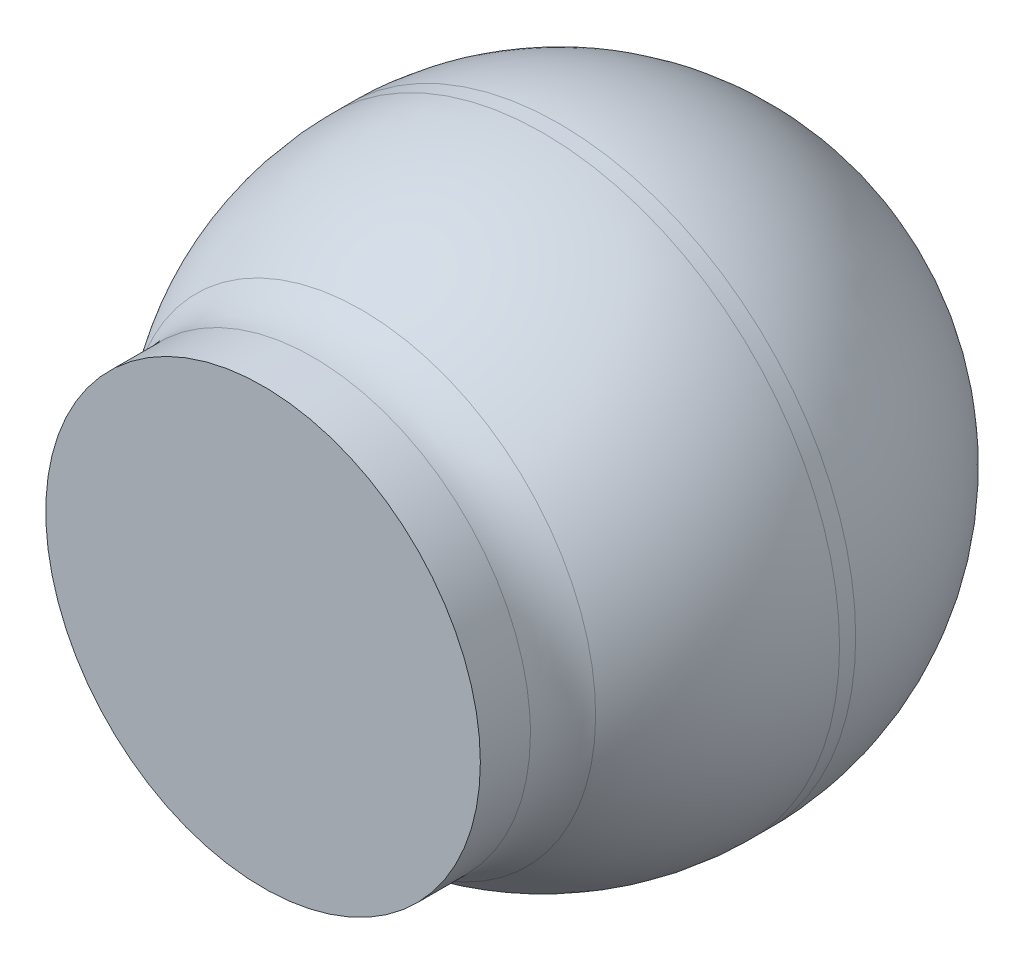
ISO-10303-21;
HEADER;
FILE_DESCRIPTION(('STEP AP214'),'2;1');
FILE_NAME('part.step','',(''),(''),'','','');
FILE_SCHEMA(('AUTOMOTIVE_DESIGN { 1 0 10303 214 1 1 1 1 }'));
ENDSEC;
DATA;
#1=APPLICATION_CONTEXT('core data for automotive mechanical design processes');
#2=APPLICATION_PROTOCOL_DEFINITION('international standard','automotive_design',2000,#1);
#3=PRODUCT_CONTEXT('',#1,'mechanical');
#4=PRODUCT('Part','Part','',(#3));
#5=PRODUCT_RELATED_PRODUCT_CATEGORY('part','',(#4));
#6=PRODUCT_DEFINITION_FORMATION('','',#4);
#7=PRODUCT_DEFINITION_CONTEXT('part definition',#1,'design');
#8=PRODUCT_DEFINITION('design','',#6,#7);
#9=PRODUCT_DEFINITION_SHAPE('','',#8);
#10=(LENGTH_UNIT() NAMED_UNIT(*) SI_UNIT(.MILLI.,.METRE.));
#11=(NAMED_UNIT(*) PLANE_ANGLE_UNIT() SI_UNIT($,.RADIAN.));
#12=(NAMED_UNIT(*) SI_UNIT($,.STERADIAN.) SOLID_ANGLE_UNIT());
#13=UNCERTAINTY_MEASURE_WITH_UNIT(LENGTH_MEASURE(1.E-05),#10,'distance_accuracy_value','');
#14=(GEOMETRIC_REPRESENTATION_CONTEXT(3) GLOBAL_UNCERTAINTY_ASSIGNED_CONTEXT((#13)) GLOBAL_UNIT_ASSIGNED_CONTEXT((#10,
#11,#12)) REPRESENTATION_CONTEXT('',''));
#15=CARTESIAN_POINT('',(0.,0.,0.));
#16=DIRECTION('',(0.,0.,1.));
#17=DIRECTION('',(1.,0.,0.));
#18=AXIS2_PLACEMENT_3D('',#15,#16,#17);
#19=CARTESIAN_POINT('',(-1.832919922269,-5.321349291452,10.006534503384));
#20=DIRECTION('',(0.,0.,-1.));
#21=DIRECTION('',(-1.,0.,0.));
#22=AXIS2_PLACEMENT_3D('',#19,#20,#21);
#23=PLANE('',#22);
#24=CARTESIAN_POINT('',(-1.832919922269,-5.321349291452,10.006534503384));
#25=DIRECTION('',(0.,0.,1.));
#26=DIRECTION('',(1.,0.,0.));
#27=AXIS2_PLACEMENT_3D('',#24,#25,#26);
#28=CIRCLE('',#27,0.275);
#29=CARTESIAN_POINT('',(-1.557919922269,-5.321349291452,10.006534503384));
#30=VERTEX_POINT('',#29);
#31=EDGE_CURVE('E20',#30,#30,#28,.F.);
#32=ORIENTED_EDGE('',*,*,#31,.F.);
#33=EDGE_LOOP('',(#32));
#34=FACE_BOUND('',#33,.T.);
#35=ADVANCED_FACE('F17',(#34),#23,.F.);
#36=CARTESIAN_POINT('',(-1.832919922269,-5.321349291452,9.906534503384));
#37=DIRECTION('',(0.,0.,1.));
#38=DIRECTION('',(1.,0.,0.));
#39=AXIS2_PLACEMENT_3D('',#36,#37,#38);
#40=CYLINDRICAL_SURFACE('',#39,0.275);
#41=CARTESIAN_POINT('',(-1.832919922269,-5.321349291452,9.943180457728));
#42=DIRECTION('',(0.,0.,-1.));
#43=DIRECTION('',(0.996700902337583,0.0811622527992438,0.));
#44=AXIS2_PLACEMENT_3D('',#41,#42,#43);
#45=CIRCLE('',#44,0.275);
#46=CARTESIAN_POINT('',(-1.55882717412616,-5.29902967193221,9.943180457728));
#47=VERTEX_POINT('',#46);
#48=EDGE_CURVE('E65',#47,#47,#45,.F.);
#49=ORIENTED_EDGE('',*,*,#48,.T.);
#50=EDGE_LOOP('',(#49));
#51=FACE_BOUND('',#50,.T.);
#52=ORIENTED_EDGE('',*,*,#31,.T.);
#53=EDGE_LOOP('',(#52));
#54=FACE_BOUND('',#53,.T.);
#55=ADVANCED_FACE('F62',(#51,#54),#40,.T.);
#56=CARTESIAN_POINT('',(-1.832919922269,-5.321349291452,9.943180457728));
#57=DIRECTION('',(0.,0.,-1.));
#58=DIRECTION('',(0.996700902337583,0.0811622527992448,0.));
#59=AXIS2_PLACEMENT_3D('',#56,#57,#58);
#60=TOROIDAL_SURFACE('',#59,0.375,0.1);
#61=ORIENTED_EDGE('',*,*,#48,.F.);
#62=EDGE_LOOP('',(#61));
#63=FACE_BOUND('',#62,.T.);
#64=CARTESIAN_POINT('',(-1.832919922269,-5.321349291452,9.881744931236));
#65=DIRECTION('',(0.,0.,-1.));
#66=DIRECTION('',(-0.996700902337597,-0.0811622527990622,0.));
#67=AXIS2_PLACEMENT_3D('',#64,#65,#66);
#68=CIRCLE('',#67,0.296097046412665);
#69=CARTESIAN_POINT('',(-2.128040115608,-5.345381194786,9.881744931236));
#70=VERTEX_POINT('',#69);
#71=EDGE_CURVE('E39',#70,#70,#68,.T.);
#72=ORIENTED_EDGE('',*,*,#71,.F.);
#73=EDGE_LOOP('',(#72));
#74=FACE_BOUND('',#73,.T.);
#75=ADVANCED_FACE('F57',(#63,#74),#60,.F.);
#76=CARTESIAN_POINT('',(-2.206682760645,-5.351785136252,9.651976062157));
#77=CARTESIAN_POINT('',(-2.206682760645,-5.351785136252,9.701461392103));
#78=CARTESIAN_POINT('',(-2.198526217348,-5.351120941579,9.750947004335));
#79=CARTESIAN_POINT('',(-2.182207085349,-5.349792059952,9.798626332798));
#80=CARTESIAN_POINT('',(-2.158341390838,-5.347848654938,9.842699544317));
#81=CARTESIAN_POINT('',(-2.128040115608,-5.345381194786,9.881744931236));
#82=(BOUNDED_CURVE() B_SPLINE_CURVE(5,(#76,#77,#78,#79,#80,#81),.UNSPECIFIED.,.F.,
.F.) B_SPLINE_CURVE_WITH_KNOTS((6,6),(0.,0.661568582165),
.UNSPECIFIED.) CURVE() GEOMETRIC_REPRESENTATION_ITEM() RATIONAL_B_SPLINE_CURVE((1.,1.,1.,1.,1.,1.)) REPRESENTATION_ITEM(''));
#83=CARTESIAN_POINT('',(-1.832919922269,-5.321349291452,9.651976062157));
#84=DIRECTION('',(0.,0.,-1.));
#85=AXIS1_PLACEMENT('',#83,#84);
#86=SURFACE_OF_REVOLUTION('',#82,#85);
#87=CARTESIAN_POINT('',(-1.832919922269,-5.321349291452,9.651976062157));
#88=DIRECTION('',(0.,0.,1.));
#89=DIRECTION('',(1.,0.,0.));
#90=AXIS2_PLACEMENT_3D('',#87,#88,#89);
#91=CIRCLE('',#90,0.375);
#92=CARTESIAN_POINT('',(-1.457919922269,-5.321349291452,9.651976062157));
#93=VERTEX_POINT('',#92);
#94=EDGE_CURVE('E36',#93,#93,#91,.F.);
#95=ORIENTED_EDGE('',*,*,#94,.F.);
#96=EDGE_LOOP('',(#95));
#97=FACE_BOUND('',#96,.T.);
#98=ORIENTED_EDGE('',*,*,#71,.T.);
#99=EDGE_LOOP('',(#98));
#100=FACE_BOUND('',#99,.T.);
#101=ADVANCED_FACE('F53',(#97,#100),#86,.F.);
#102=CARTESIAN_POINT('',(-1.832919922269,-5.321349291452,9.256534503384));
#103=DIRECTION('',(0.,0.,1.));
#104=DIRECTION('',(1.,0.,0.));
#105=AXIS2_PLACEMENT_3D('',#102,#103,#104);
#106=CYLINDRICAL_SURFACE('',#105,0.375);
#107=CARTESIAN_POINT('',(-1.832919922269,-5.321349291452,9.631534503384));
#108=DIRECTION('',(0.,0.,-1.));
#109=DIRECTION('',(0.0811622527992362,-0.996700902337583,0.));
#110=AXIS2_PLACEMENT_3D('',#107,#108,#109);
#111=CIRCLE('',#110,0.375);
#112=CARTESIAN_POINT('',(-1.80248407746929,-5.69511212982859,9.631534503384));
#113=VERTEX_POINT('',#112);
#114=CARTESIAN_POINT('',(-1.86335576706871,-4.94758645307541,9.631534503384));
#115=VERTEX_POINT('',#114);
#116=EDGE_CURVE('E11',#113,#115,#111,.T.);
#117=ORIENTED_EDGE('',*,*,#116,.F.);
#118=CARTESIAN_POINT('',(-1.832919922269,-5.321349291452,9.631534503384));
#119=DIRECTION('',(0.,0.,1.));
#120=DIRECTION('',(0.0811622527992359,-0.996700902337583,0.));
#121=AXIS2_PLACEMENT_3D('',#118,#119,#120);
#122=CIRCLE('',#121,0.375);
#123=EDGE_CURVE('E25',#115,#113,#122,.F.);
#124=ORIENTED_EDGE('',*,*,#123,.F.);
#125=EDGE_LOOP('',(#117,#124));
#126=FACE_BOUND('',#125,.T.);
#127=ORIENTED_EDGE('',*,*,#94,.T.);
#128=EDGE_LOOP('',(#127));
#129=FACE_BOUND('',#128,.T.);
#130=ADVANCED_FACE('F34',(#126,#129),#106,.T.);
#131=CARTESIAN_POINT('',(-1.832919922269,-5.321349291452,9.631534503384));
#132=DIRECTION('',(0.0811622527992361,-0.996700902337583,0.));
#133=DIRECTION('',(-0.996700902337583,-0.0811622527992361,0.));
#134=AXIS2_PLACEMENT_3D('',#131,#132,#133);
#135=SPHERICAL_SURFACE('',#134,0.375);
#136=ORIENTED_EDGE('',*,*,#123,.T.);
#137=ORIENTED_EDGE('',*,*,#116,.T.);
#138=EDGE_LOOP('',(#136,#137));
#139=FACE_BOUND('',#138,.T.);
#140=ADVANCED_FACE('F32',(#139),#135,.T.);
#141=CLOSED_SHELL('',(#35,#55,#75,#101,#130,#140));
#142=MANIFOLD_SOLID_BREP('B1',#141);
#143=ADVANCED_BREP_SHAPE_REPRESENTATION('',(#18,#142),#14);
#144=SHAPE_DEFINITION_REPRESENTATION(#9,#143);
ENDSEC;
END-ISO-10303-21;
